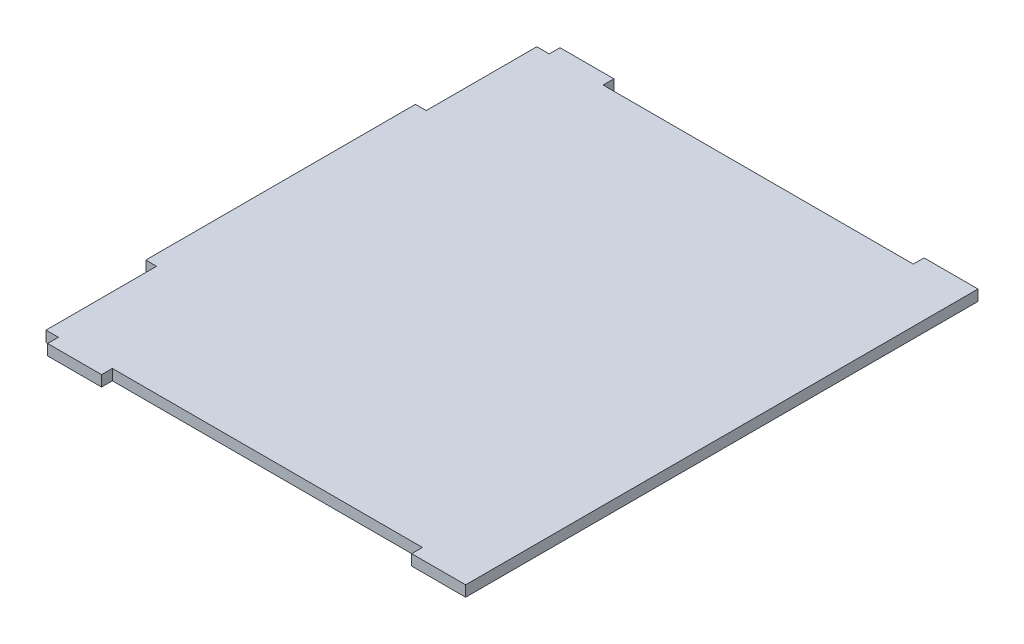
ISO-10303-21;
HEADER;
FILE_DESCRIPTION(('STEP AP214'),'2;1');
FILE_NAME('part.step','',(''),(''),'','','');
FILE_SCHEMA(('AUTOMOTIVE_DESIGN { 1 0 10303 214 1 1 1 1 }'));
ENDSEC;
DATA;
#1=APPLICATION_CONTEXT('core data for automotive mechanical design processes');
#2=APPLICATION_PROTOCOL_DEFINITION('international standard','automotive_design',2000,#1);
#3=PRODUCT_CONTEXT('',#1,'mechanical');
#4=PRODUCT('Part','Part','',(#3));
#5=PRODUCT_RELATED_PRODUCT_CATEGORY('part','',(#4));
#6=PRODUCT_DEFINITION_FORMATION('','',#4);
#7=PRODUCT_DEFINITION_CONTEXT('part definition',#1,'design');
#8=PRODUCT_DEFINITION('design','',#6,#7);
#9=PRODUCT_DEFINITION_SHAPE('','',#8);
#10=(LENGTH_UNIT() NAMED_UNIT(*) SI_UNIT(.MILLI.,.METRE.));
#11=(NAMED_UNIT(*) PLANE_ANGLE_UNIT() SI_UNIT($,.RADIAN.));
#12=(NAMED_UNIT(*) SI_UNIT($,.STERADIAN.) SOLID_ANGLE_UNIT());
#13=UNCERTAINTY_MEASURE_WITH_UNIT(LENGTH_MEASURE(1.E-05),#10,'distance_accuracy_value','');
#14=(GEOMETRIC_REPRESENTATION_CONTEXT(3) GLOBAL_UNCERTAINTY_ASSIGNED_CONTEXT((#13)) GLOBAL_UNIT_ASSIGNED_CONTEXT((#10,
#11,#12)) REPRESENTATION_CONTEXT('',''));
#15=CARTESIAN_POINT('',(0.,0.,0.));
#16=DIRECTION('',(0.,0.,1.));
#17=DIRECTION('',(1.,0.,0.));
#18=AXIS2_PLACEMENT_3D('',#15,#16,#17);
#19=CARTESIAN_POINT('',(61.8007292383684,4.,-95.0000000000068));
#20=DIRECTION('',(0.,0.,-1.));
#21=DIRECTION('',(-1.,0.,0.));
#22=AXIS2_PLACEMENT_3D('',#19,#20,#21);
#23=PLANE('',#22);
#24=DIRECTION('',(1.,0.,0.));
#25=VECTOR('',#24,1.);
#26=CARTESIAN_POINT('',(61.8007292383684,0.,-95.0000000000068));
#27=LINE('',#26,#25);
#28=CARTESIAN_POINT('',(61.8007292383684,0.,-95.0000000000068));
#29=VERTEX_POINT('',#28);
#30=CARTESIAN_POINT('',(81.805,0.,-95.0000000000068));
#31=VERTEX_POINT('',#30);
#32=EDGE_CURVE('E205',#29,#31,#27,.T.);
#33=ORIENTED_EDGE('',*,*,#32,.F.);
#34=DIRECTION('',(0.,-1.,0.));
#35=VECTOR('',#34,1.);
#36=CARTESIAN_POINT('',(61.8007292383684,4.,-95.0000000000068));
#37=LINE('',#36,#35);
#38=CARTESIAN_POINT('',(61.8007292383684,4.,-95.0000000000068));
#39=VERTEX_POINT('',#38);
#40=EDGE_CURVE('E11',#39,#29,#37,.T.);
#41=ORIENTED_EDGE('',*,*,#40,.F.);
#42=DIRECTION('',(1.,0.,0.));
#43=VECTOR('',#42,1.);
#44=CARTESIAN_POINT('',(61.8007292383684,4.,-95.0000000000068));
#45=LINE('',#44,#43);
#46=CARTESIAN_POINT('',(81.805,4.,-95.0000000000068));
#47=VERTEX_POINT('',#46);
#48=EDGE_CURVE('E257',#39,#47,#45,.T.);
#49=ORIENTED_EDGE('',*,*,#48,.T.);
#50=DIRECTION('',(0.,-1.,0.));
#51=VECTOR('',#50,1.);
#52=CARTESIAN_POINT('',(81.805,4.,-95.0000000000068));
#53=LINE('',#52,#51);
#54=EDGE_CURVE('E39',#47,#31,#53,.T.);
#55=ORIENTED_EDGE('',*,*,#54,.T.);
#56=EDGE_LOOP('',(#33,#41,#49,#55));
#57=FACE_BOUND('',#56,.T.);
#58=ADVANCED_FACE('F36',(#57),#23,.T.);
#59=CARTESIAN_POINT('',(61.8007292383684,4.,-91.0000000000001));
#60=DIRECTION('',(-1.,0.,0.));
#61=DIRECTION('',(0.,0.,1.));
#62=AXIS2_PLACEMENT_3D('',#59,#60,#61);
#63=PLANE('',#62);
#64=DIRECTION('',(0.,0.,-1.));
#65=VECTOR('',#64,1.);
#66=CARTESIAN_POINT('',(61.8007292383684,0.,-91.0000000000001));
#67=LINE('',#66,#65);
#68=CARTESIAN_POINT('',(61.8007292383684,0.,-91.0000000000001));
#69=VERTEX_POINT('',#68);
#70=EDGE_CURVE('E255',#69,#29,#67,.T.);
#71=ORIENTED_EDGE('',*,*,#70,.F.);
#72=DIRECTION('',(0.,-1.,0.));
#73=VECTOR('',#72,1.);
#74=CARTESIAN_POINT('',(61.8007292383684,4.,-91.0000000000001));
#75=LINE('',#74,#73);
#76=CARTESIAN_POINT('',(61.8007292383684,4.,-91.0000000000001));
#77=VERTEX_POINT('',#76);
#78=EDGE_CURVE('E45',#77,#69,#75,.T.);
#79=ORIENTED_EDGE('',*,*,#78,.F.);
#80=DIRECTION('',(0.,0.,-1.));
#81=VECTOR('',#80,1.);
#82=CARTESIAN_POINT('',(61.8007292383684,4.,-91.0000000000001));
#83=LINE('',#82,#81);
#84=EDGE_CURVE('E195',#77,#39,#83,.T.);
#85=ORIENTED_EDGE('',*,*,#84,.T.);
#86=ORIENTED_EDGE('',*,*,#40,.T.);
#87=EDGE_LOOP('',(#71,#79,#85,#86));
#88=FACE_BOUND('',#87,.T.);
#89=ADVANCED_FACE('F298',(#88),#63,.T.);
#90=CARTESIAN_POINT('',(-53.1992707616316,4.,-91.0000000000001));
#91=DIRECTION('',(0.,0.,-1.));
#92=DIRECTION('',(-1.,0.,0.));
#93=AXIS2_PLACEMENT_3D('',#90,#91,#92);
#94=PLANE('',#93);
#95=DIRECTION('',(1.,0.,0.));
#96=VECTOR('',#95,1.);
#97=CARTESIAN_POINT('',(-53.1992707616316,0.,-91.0000000000001));
#98=LINE('',#97,#96);
#99=CARTESIAN_POINT('',(-53.1992707616316,0.,-91.0000000000001));
#100=VERTEX_POINT('',#99);
#101=EDGE_CURVE('E182',#100,#69,#98,.T.);
#102=ORIENTED_EDGE('',*,*,#101,.F.);
#103=DIRECTION('',(0.,-1.,0.));
#104=VECTOR('',#103,1.);
#105=CARTESIAN_POINT('',(-53.1992707616316,4.,-91.0000000000001));
#106=LINE('',#105,#104);
#107=CARTESIAN_POINT('',(-53.1992707616316,4.,-91.0000000000001));
#108=VERTEX_POINT('',#107);
#109=EDGE_CURVE('E177',#108,#100,#106,.T.);
#110=ORIENTED_EDGE('',*,*,#109,.F.);
#111=DIRECTION('',(1.,0.,0.));
#112=VECTOR('',#111,1.);
#113=CARTESIAN_POINT('',(-53.1992707616316,4.,-91.0000000000001));
#114=LINE('',#113,#112);
#115=EDGE_CURVE('E180',#108,#77,#114,.T.);
#116=ORIENTED_EDGE('',*,*,#115,.T.);
#117=ORIENTED_EDGE('',*,*,#78,.T.);
#118=EDGE_LOOP('',(#102,#110,#116,#117));
#119=FACE_BOUND('',#118,.T.);
#120=ADVANCED_FACE('F179',(#119),#94,.T.);
#121=CARTESIAN_POINT('',(-53.1992707616316,4.,-95.0000000000068));
#122=DIRECTION('',(1.,0.,0.));
#123=DIRECTION('',(0.,0.,-1.));
#124=AXIS2_PLACEMENT_3D('',#121,#122,#123);
#125=PLANE('',#124);
#126=DIRECTION('',(0.,0.,1.));
#127=VECTOR('',#126,1.);
#128=CARTESIAN_POINT('',(-53.1992707616316,0.,-95.0000000000068));
#129=LINE('',#128,#127);
#130=CARTESIAN_POINT('',(-53.1992707616316,0.,-95.0000000000068));
#131=VERTEX_POINT('',#130);
#132=EDGE_CURVE('E252',#131,#100,#129,.T.);
#133=ORIENTED_EDGE('',*,*,#132,.F.);
#134=DIRECTION('',(0.,-1.,0.));
#135=VECTOR('',#134,1.);
#136=CARTESIAN_POINT('',(-53.1992707616316,4.,-95.0000000000068));
#137=LINE('',#136,#135);
#138=CARTESIAN_POINT('',(-53.1992707616316,4.,-95.0000000000068));
#139=VERTEX_POINT('',#138);
#140=EDGE_CURVE('E187',#139,#131,#137,.T.);
#141=ORIENTED_EDGE('',*,*,#140,.F.);
#142=DIRECTION('',(0.,0.,1.));
#143=VECTOR('',#142,1.);
#144=CARTESIAN_POINT('',(-53.1992707616316,4.,-95.0000000000068));
#145=LINE('',#144,#143);
#146=EDGE_CURVE('E193',#139,#108,#145,.T.);
#147=ORIENTED_EDGE('',*,*,#146,.T.);
#148=ORIENTED_EDGE('',*,*,#109,.T.);
#149=EDGE_LOOP('',(#133,#141,#147,#148));
#150=FACE_BOUND('',#149,.T.);
#151=ADVANCED_FACE('F197',(#150),#125,.T.);
#152=CARTESIAN_POINT('',(-73.1992707616316,4.,-95.0000000000067));
#153=DIRECTION('',(0.,0.,-1.));
#154=DIRECTION('',(-1.,0.,0.));
#155=AXIS2_PLACEMENT_3D('',#152,#153,#154);
#156=PLANE('',#155);
#157=DIRECTION('',(1.,0.,0.));
#158=VECTOR('',#157,1.);
#159=CARTESIAN_POINT('',(-73.1992707616316,0.,-95.0000000000067));
#160=LINE('',#159,#158);
#161=CARTESIAN_POINT('',(-73.1992707616316,0.,-95.0000000000067));
#162=VERTEX_POINT('',#161);
#163=EDGE_CURVE('E249',#162,#131,#160,.T.);
#164=ORIENTED_EDGE('',*,*,#163,.F.);
#165=DIRECTION('',(0.,-1.,0.));
#166=VECTOR('',#165,1.);
#167=CARTESIAN_POINT('',(-73.1992707616316,4.,-95.0000000000067));
#168=LINE('',#167,#166);
#169=CARTESIAN_POINT('',(-73.1992707616316,4.,-95.0000000000067));
#170=VERTEX_POINT('',#169);
#171=EDGE_CURVE('E261',#170,#162,#168,.T.);
#172=ORIENTED_EDGE('',*,*,#171,.F.);
#173=DIRECTION('',(1.,0.,0.));
#174=VECTOR('',#173,1.);
#175=CARTESIAN_POINT('',(-73.1992707616316,4.,-95.0000000000067));
#176=LINE('',#175,#174);
#177=EDGE_CURVE('E198',#170,#139,#176,.T.);
#178=ORIENTED_EDGE('',*,*,#177,.T.);
#179=ORIENTED_EDGE('',*,*,#140,.T.);
#180=EDGE_LOOP('',(#164,#172,#178,#179));
#181=FACE_BOUND('',#180,.T.);
#182=ADVANCED_FACE('F311',(#181),#156,.T.);
#183=CARTESIAN_POINT('',(-73.1992707616316,4.,-91.0000000000001));
#184=DIRECTION('',(-1.,0.,0.));
#185=DIRECTION('',(0.,0.,1.));
#186=AXIS2_PLACEMENT_3D('',#183,#184,#185);
#187=PLANE('',#186);
#188=DIRECTION('',(0.,0.,-1.));
#189=VECTOR('',#188,1.);
#190=CARTESIAN_POINT('',(-73.1992707616316,0.,-91.0000000000001));
#191=LINE('',#190,#189);
#192=CARTESIAN_POINT('',(-73.1992707616316,0.,-91.0000000000001));
#193=VERTEX_POINT('',#192);
#194=EDGE_CURVE('E246',#193,#162,#191,.T.);
#195=ORIENTED_EDGE('',*,*,#194,.F.);
#196=DIRECTION('',(0.,-1.,0.));
#197=VECTOR('',#196,1.);
#198=CARTESIAN_POINT('',(-73.1992707616316,4.,-91.0000000000001));
#199=LINE('',#198,#197);
#200=CARTESIAN_POINT('',(-73.1992707616316,4.,-91.0000000000001));
#201=VERTEX_POINT('',#200);
#202=EDGE_CURVE('E263',#201,#193,#199,.T.);
#203=ORIENTED_EDGE('',*,*,#202,.F.);
#204=DIRECTION('',(0.,0.,-1.));
#205=VECTOR('',#204,1.);
#206=CARTESIAN_POINT('',(-73.1992707616316,4.,-91.0000000000001));
#207=LINE('',#206,#205);
#208=EDGE_CURVE('E200',#201,#170,#207,.T.);
#209=ORIENTED_EDGE('',*,*,#208,.T.);
#210=ORIENTED_EDGE('',*,*,#171,.T.);
#211=EDGE_LOOP('',(#195,#203,#209,#210));
#212=FACE_BOUND('',#211,.T.);
#213=ADVANCED_FACE('F314',(#212),#187,.T.);
#214=CARTESIAN_POINT('',(-77.8049999999999,4.,-91.0000000000001));
#215=DIRECTION('',(0.,0.,-1.));
#216=DIRECTION('',(-1.,0.,0.));
#217=AXIS2_PLACEMENT_3D('',#214,#215,#216);
#218=PLANE('',#217);
#219=DIRECTION('',(1.,0.,0.));
#220=VECTOR('',#219,1.);
#221=CARTESIAN_POINT('',(-77.8049999999999,0.,-91.0000000000001));
#222=LINE('',#221,#220);
#223=CARTESIAN_POINT('',(-77.8049999999999,0.,-91.0000000000001));
#224=VERTEX_POINT('',#223);
#225=EDGE_CURVE('E243',#224,#193,#222,.T.);
#226=ORIENTED_EDGE('',*,*,#225,.F.);
#227=DIRECTION('',(0.,-1.,0.));
#228=VECTOR('',#227,1.);
#229=CARTESIAN_POINT('',(-77.8049999999999,4.,-91.0000000000001));
#230=LINE('',#229,#228);
#231=CARTESIAN_POINT('',(-77.8049999999999,4.,-91.0000000000001));
#232=VERTEX_POINT('',#231);
#233=EDGE_CURVE('E265',#232,#224,#230,.T.);
#234=ORIENTED_EDGE('',*,*,#233,.F.);
#235=DIRECTION('',(1.,0.,0.));
#236=VECTOR('',#235,1.);
#237=CARTESIAN_POINT('',(-77.8049999999999,4.,-91.0000000000001));
#238=LINE('',#237,#236);
#239=EDGE_CURVE('E551',#232,#201,#238,.T.);
#240=ORIENTED_EDGE('',*,*,#239,.T.);
#241=ORIENTED_EDGE('',*,*,#202,.T.);
#242=EDGE_LOOP('',(#226,#234,#240,#241));
#243=FACE_BOUND('',#242,.T.);
#244=ADVANCED_FACE('F318',(#243),#218,.T.);
#245=CARTESIAN_POINT('',(-77.8049999999999,4.,-50.));
#246=DIRECTION('',(-1.,0.,0.));
#247=DIRECTION('',(0.,0.,1.));
#248=AXIS2_PLACEMENT_3D('',#245,#246,#247);
#249=PLANE('',#248);
#250=DIRECTION('',(0.,0.,-1.));
#251=VECTOR('',#250,1.);
#252=CARTESIAN_POINT('',(-77.8049999999999,0.,-50.));
#253=LINE('',#252,#251);
#254=CARTESIAN_POINT('',(-77.8049999999999,0.,-50.));
#255=VERTEX_POINT('',#254);
#256=EDGE_CURVE('E240',#255,#224,#253,.T.);
#257=ORIENTED_EDGE('',*,*,#256,.F.);
#258=DIRECTION('',(0.,-1.,0.));
#259=VECTOR('',#258,1.);
#260=CARTESIAN_POINT('',(-77.8049999999999,4.,-50.));
#261=LINE('',#260,#259);
#262=CARTESIAN_POINT('',(-77.8049999999999,4.,-50.));
#263=VERTEX_POINT('',#262);
#264=EDGE_CURVE('E267',#263,#255,#261,.T.);
#265=ORIENTED_EDGE('',*,*,#264,.F.);
#266=DIRECTION('',(0.,0.,-1.));
#267=VECTOR('',#266,1.);
#268=CARTESIAN_POINT('',(-77.8049999999999,4.,-50.));
#269=LINE('',#268,#267);
#270=EDGE_CURVE('E544',#263,#232,#269,.T.);
#271=ORIENTED_EDGE('',*,*,#270,.T.);
#272=ORIENTED_EDGE('',*,*,#233,.T.);
#273=EDGE_LOOP('',(#257,#265,#271,#272));
#274=FACE_BOUND('',#273,.T.);
#275=ADVANCED_FACE('F322',(#274),#249,.T.);
#276=CARTESIAN_POINT('',(-77.8049999999999,4.,-50.));
#277=DIRECTION('',(0.,0.,1.));
#278=DIRECTION('',(1.,0.,0.));
#279=AXIS2_PLACEMENT_3D('',#276,#277,#278);
#280=PLANE('',#279);
#281=DIRECTION('',(-1.,0.,0.));
#282=VECTOR('',#281,1.);
#283=CARTESIAN_POINT('',(-77.8049999999999,0.,-50.));
#284=LINE('',#283,#282);
#285=CARTESIAN_POINT('',(-81.805,0.,-50.));
#286=VERTEX_POINT('',#285);
#287=EDGE_CURVE('E237',#255,#286,#284,.T.);
#288=ORIENTED_EDGE('',*,*,#287,.T.);
#289=DIRECTION('',(0.,-1.,0.));
#290=VECTOR('',#289,1.);
#291=CARTESIAN_POINT('',(-81.805,4.,-50.));
#292=LINE('',#291,#290);
#293=CARTESIAN_POINT('',(-81.805,4.,-50.));
#294=VERTEX_POINT('',#293);
#295=EDGE_CURVE('E269',#294,#286,#292,.T.);
#296=ORIENTED_EDGE('',*,*,#295,.F.);
#297=DIRECTION('',(-1.,0.,0.));
#298=VECTOR('',#297,1.);
#299=CARTESIAN_POINT('',(-77.8049999999999,4.,-50.));
#300=LINE('',#299,#298);
#301=EDGE_CURVE('E553',#263,#294,#300,.T.);
#302=ORIENTED_EDGE('',*,*,#301,.F.);
#303=ORIENTED_EDGE('',*,*,#264,.T.);
#304=EDGE_LOOP('',(#288,#296,#302,#303));
#305=FACE_BOUND('',#304,.T.);
#306=ADVANCED_FACE('F326',(#305),#280,.F.);
#307=CARTESIAN_POINT('',(-81.805,4.,50.));
#308=DIRECTION('',(-1.,0.,0.));
#309=DIRECTION('',(0.,0.,1.));
#310=AXIS2_PLACEMENT_3D('',#307,#308,#309);
#311=PLANE('',#310);
#312=DIRECTION('',(0.,0.,-1.));
#313=VECTOR('',#312,1.);
#314=CARTESIAN_POINT('',(-81.805,0.,50.));
#315=LINE('',#314,#313);
#316=CARTESIAN_POINT('',(-81.805,0.,50.));
#317=VERTEX_POINT('',#316);
#318=EDGE_CURVE('E234',#317,#286,#315,.T.);
#319=ORIENTED_EDGE('',*,*,#318,.F.);
#320=DIRECTION('',(0.,-1.,0.));
#321=VECTOR('',#320,1.);
#322=CARTESIAN_POINT('',(-81.805,4.,50.));
#323=LINE('',#322,#321);
#324=CARTESIAN_POINT('',(-81.805,4.,50.));
#325=VERTEX_POINT('',#324);
#326=EDGE_CURVE('E271',#325,#317,#323,.T.);
#327=ORIENTED_EDGE('',*,*,#326,.F.);
#328=DIRECTION('',(0.,0.,-1.));
#329=VECTOR('',#328,1.);
#330=CARTESIAN_POINT('',(-81.805,4.,50.));
#331=LINE('',#330,#329);
#332=EDGE_CURVE('E538',#325,#294,#331,.T.);
#333=ORIENTED_EDGE('',*,*,#332,.T.);
#334=ORIENTED_EDGE('',*,*,#295,.T.);
#335=EDGE_LOOP('',(#319,#327,#333,#334));
#336=FACE_BOUND('',#335,.T.);
#337=ADVANCED_FACE('F330',(#336),#311,.T.);
#338=CARTESIAN_POINT('',(-81.805,4.,50.));
#339=DIRECTION('',(0.,0.,-1.));
#340=DIRECTION('',(-1.,0.,0.));
#341=AXIS2_PLACEMENT_3D('',#338,#339,#340);
#342=PLANE('',#341);
#343=DIRECTION('',(1.,0.,0.));
#344=VECTOR('',#343,1.);
#345=CARTESIAN_POINT('',(-81.805,0.,50.));
#346=LINE('',#345,#344);
#347=CARTESIAN_POINT('',(-77.8049999999999,0.,50.));
#348=VERTEX_POINT('',#347);
#349=EDGE_CURVE('E231',#317,#348,#346,.T.);
#350=ORIENTED_EDGE('',*,*,#349,.T.);
#351=DIRECTION('',(0.,-1.,0.));
#352=VECTOR('',#351,1.);
#353=CARTESIAN_POINT('',(-77.8049999999999,4.,50.));
#354=LINE('',#353,#352);
#355=CARTESIAN_POINT('',(-77.8049999999999,4.,50.));
#356=VERTEX_POINT('',#355);
#357=EDGE_CURVE('E273',#356,#348,#354,.T.);
#358=ORIENTED_EDGE('',*,*,#357,.F.);
#359=DIRECTION('',(1.,0.,0.));
#360=VECTOR('',#359,1.);
#361=CARTESIAN_POINT('',(-81.805,4.,50.));
#362=LINE('',#361,#360);
#363=EDGE_CURVE('E558',#325,#356,#362,.T.);
#364=ORIENTED_EDGE('',*,*,#363,.F.);
#365=ORIENTED_EDGE('',*,*,#326,.T.);
#366=EDGE_LOOP('',(#350,#358,#364,#365));
#367=FACE_BOUND('',#366,.T.);
#368=ADVANCED_FACE('F334',(#367),#342,.F.);
#369=CARTESIAN_POINT('',(-77.8049999999999,4.,91.0000000000001));
#370=DIRECTION('',(-1.,0.,0.));
#371=DIRECTION('',(0.,0.,1.));
#372=AXIS2_PLACEMENT_3D('',#369,#370,#371);
#373=PLANE('',#372);
#374=DIRECTION('',(0.,0.,-1.));
#375=VECTOR('',#374,1.);
#376=CARTESIAN_POINT('',(-77.8049999999999,0.,91.0000000000001));
#377=LINE('',#376,#375);
#378=CARTESIAN_POINT('',(-77.8049999999999,0.,91.0000000000001));
#379=VERTEX_POINT('',#378);
#380=EDGE_CURVE('E228',#379,#348,#377,.T.);
#381=ORIENTED_EDGE('',*,*,#380,.F.);
#382=DIRECTION('',(0.,-1.,0.));
#383=VECTOR('',#382,1.);
#384=CARTESIAN_POINT('',(-77.8049999999999,4.,91.0000000000001));
#385=LINE('',#384,#383);
#386=CARTESIAN_POINT('',(-77.8049999999999,4.,91.0000000000001));
#387=VERTEX_POINT('',#386);
#388=EDGE_CURVE('E275',#387,#379,#385,.T.);
#389=ORIENTED_EDGE('',*,*,#388,.F.);
#390=DIRECTION('',(0.,0.,-1.));
#391=VECTOR('',#390,1.);
#392=CARTESIAN_POINT('',(-77.8049999999999,4.,91.0000000000001));
#393=LINE('',#392,#391);
#394=EDGE_CURVE('E531',#387,#356,#393,.T.);
#395=ORIENTED_EDGE('',*,*,#394,.T.);
#396=ORIENTED_EDGE('',*,*,#357,.T.);
#397=EDGE_LOOP('',(#381,#389,#395,#396));
#398=FACE_BOUND('',#397,.T.);
#399=ADVANCED_FACE('F338',(#398),#373,.T.);
#400=CARTESIAN_POINT('',(-77.8049999999999,4.,91.0000000000001));
#401=DIRECTION('',(0.,0.,-1.));
#402=DIRECTION('',(-1.,0.,0.));
#403=AXIS2_PLACEMENT_3D('',#400,#401,#402);
#404=PLANE('',#403);
#405=DIRECTION('',(1.,0.,0.));
#406=VECTOR('',#405,1.);
#407=CARTESIAN_POINT('',(-77.8049999999999,0.,91.0000000000001));
#408=LINE('',#407,#406);
#409=CARTESIAN_POINT('',(-73.1992707616316,0.,91.0000000000001));
#410=VERTEX_POINT('',#409);
#411=EDGE_CURVE('E226',#379,#410,#408,.T.);
#412=ORIENTED_EDGE('',*,*,#411,.T.);
#413=DIRECTION('',(0.,-1.,0.));
#414=VECTOR('',#413,1.);
#415=CARTESIAN_POINT('',(-73.1992707616316,4.,91.0000000000001));
#416=LINE('',#415,#414);
#417=CARTESIAN_POINT('',(-73.1992707616316,4.,91.0000000000001));
#418=VERTEX_POINT('',#417);
#419=EDGE_CURVE('E277',#418,#410,#416,.T.);
#420=ORIENTED_EDGE('',*,*,#419,.F.);
#421=DIRECTION('',(1.,0.,0.));
#422=VECTOR('',#421,1.);
#423=CARTESIAN_POINT('',(-77.8049999999999,4.,91.0000000000001));
#424=LINE('',#423,#422);
#425=EDGE_CURVE('E561',#387,#418,#424,.T.);
#426=ORIENTED_EDGE('',*,*,#425,.F.);
#427=ORIENTED_EDGE('',*,*,#388,.T.);
#428=EDGE_LOOP('',(#412,#420,#426,#427));
#429=FACE_BOUND('',#428,.T.);
#430=ADVANCED_FACE('F342',(#429),#404,.F.);
#431=CARTESIAN_POINT('',(-73.1992707616316,4.,91.0000000000001));
#432=DIRECTION('',(1.,0.,0.));
#433=DIRECTION('',(0.,0.,-1.));
#434=AXIS2_PLACEMENT_3D('',#431,#432,#433);
#435=PLANE('',#434);
#436=DIRECTION('',(0.,0.,1.));
#437=VECTOR('',#436,1.);
#438=CARTESIAN_POINT('',(-73.1992707616316,0.,91.0000000000001));
#439=LINE('',#438,#437);
#440=CARTESIAN_POINT('',(-73.1992707616316,0.,95.0000000000068));
#441=VERTEX_POINT('',#440);
#442=EDGE_CURVE('E223',#410,#441,#439,.T.);
#443=ORIENTED_EDGE('',*,*,#442,.T.);
#444=DIRECTION('',(0.,-1.,0.));
#445=VECTOR('',#444,1.);
#446=CARTESIAN_POINT('',(-73.1992707616316,4.,95.0000000000068));
#447=LINE('',#446,#445);
#448=CARTESIAN_POINT('',(-73.1992707616316,4.,95.0000000000068));
#449=VERTEX_POINT('',#448);
#450=EDGE_CURVE('E280',#449,#441,#447,.T.);
#451=ORIENTED_EDGE('',*,*,#450,.F.);
#452=DIRECTION('',(0.,0.,1.));
#453=VECTOR('',#452,1.);
#454=CARTESIAN_POINT('',(-73.1992707616316,4.,91.0000000000001));
#455=LINE('',#454,#453);
#456=EDGE_CURVE('E563',#418,#449,#455,.T.);
#457=ORIENTED_EDGE('',*,*,#456,.F.);
#458=ORIENTED_EDGE('',*,*,#419,.T.);
#459=EDGE_LOOP('',(#443,#451,#457,#458));
#460=FACE_BOUND('',#459,.T.);
#461=ADVANCED_FACE('F346',(#460),#435,.F.);
#462=CARTESIAN_POINT('',(-53.1992707616316,4.,95.0000000000068));
#463=DIRECTION('',(0.,0.,1.));
#464=DIRECTION('',(1.,0.,0.));
#465=AXIS2_PLACEMENT_3D('',#462,#463,#464);
#466=PLANE('',#465);
#467=DIRECTION('',(-1.,0.,0.));
#468=VECTOR('',#467,1.);
#469=CARTESIAN_POINT('',(-53.1992707616316,0.,95.0000000000068));
#470=LINE('',#469,#468);
#471=CARTESIAN_POINT('',(-53.1992707616316,0.,95.0000000000068));
#472=VERTEX_POINT('',#471);
#473=EDGE_CURVE('E220',#472,#441,#470,.T.);
#474=ORIENTED_EDGE('',*,*,#473,.F.);
#475=DIRECTION('',(0.,-1.,0.));
#476=VECTOR('',#475,1.);
#477=CARTESIAN_POINT('',(-53.1992707616316,4.,95.0000000000068));
#478=LINE('',#477,#476);
#479=CARTESIAN_POINT('',(-53.1992707616316,4.,95.0000000000068));
#480=VERTEX_POINT('',#479);
#481=EDGE_CURVE('E282',#480,#472,#478,.T.);
#482=ORIENTED_EDGE('',*,*,#481,.F.);
#483=DIRECTION('',(-1.,0.,0.));
#484=VECTOR('',#483,1.);
#485=CARTESIAN_POINT('',(-53.1992707616316,4.,95.0000000000068));
#486=LINE('',#485,#484);
#487=EDGE_CURVE('E521',#480,#449,#486,.T.);
#488=ORIENTED_EDGE('',*,*,#487,.T.);
#489=ORIENTED_EDGE('',*,*,#450,.T.);
#490=EDGE_LOOP('',(#474,#482,#488,#489));
#491=FACE_BOUND('',#490,.T.);
#492=ADVANCED_FACE('F350',(#491),#466,.T.);
#493=CARTESIAN_POINT('',(-53.1992707616316,4.,95.0000000000068));
#494=DIRECTION('',(-1.,0.,0.));
#495=DIRECTION('',(0.,0.,1.));
#496=AXIS2_PLACEMENT_3D('',#493,#494,#495);
#497=PLANE('',#496);
#498=DIRECTION('',(0.,0.,-1.));
#499=VECTOR('',#498,1.);
#500=CARTESIAN_POINT('',(-53.1992707616316,0.,95.0000000000068));
#501=LINE('',#500,#499);
#502=CARTESIAN_POINT('',(-53.1992707616316,0.,91.0000000000001));
#503=VERTEX_POINT('',#502);
#504=EDGE_CURVE('E218',#472,#503,#501,.T.);
#505=ORIENTED_EDGE('',*,*,#504,.T.);
#506=DIRECTION('',(0.,-1.,0.));
#507=VECTOR('',#506,1.);
#508=CARTESIAN_POINT('',(-53.1992707616316,4.,91.0000000000001));
#509=LINE('',#508,#507);
#510=CARTESIAN_POINT('',(-53.1992707616316,4.,91.0000000000001));
#511=VERTEX_POINT('',#510);
#512=EDGE_CURVE('E284',#511,#503,#509,.T.);
#513=ORIENTED_EDGE('',*,*,#512,.F.);
#514=DIRECTION('',(0.,0.,-1.));
#515=VECTOR('',#514,1.);
#516=CARTESIAN_POINT('',(-53.1992707616316,4.,95.0000000000068));
#517=LINE('',#516,#515);
#518=EDGE_CURVE('E515',#480,#511,#517,.T.);
#519=ORIENTED_EDGE('',*,*,#518,.F.);
#520=ORIENTED_EDGE('',*,*,#481,.T.);
#521=EDGE_LOOP('',(#505,#513,#519,#520));
#522=FACE_BOUND('',#521,.T.);
#523=ADVANCED_FACE('F354',(#522),#497,.F.);
#524=CARTESIAN_POINT('',(-53.1992707616316,4.,91.0000000000001));
#525=DIRECTION('',(0.,0.,-1.));
#526=DIRECTION('',(-1.,0.,0.));
#527=AXIS2_PLACEMENT_3D('',#524,#525,#526);
#528=PLANE('',#527);
#529=DIRECTION('',(1.,0.,0.));
#530=VECTOR('',#529,1.);
#531=CARTESIAN_POINT('',(-53.1992707616316,0.,91.0000000000001));
#532=LINE('',#531,#530);
#533=CARTESIAN_POINT('',(61.8007292383684,0.,91.0000000000001));
#534=VERTEX_POINT('',#533);
#535=EDGE_CURVE('E216',#503,#534,#532,.T.);
#536=ORIENTED_EDGE('',*,*,#535,.T.);
#537=DIRECTION('',(0.,-1.,0.));
#538=VECTOR('',#537,1.);
#539=CARTESIAN_POINT('',(61.8007292383684,4.,91.0000000000001));
#540=LINE('',#539,#538);
#541=CARTESIAN_POINT('',(61.8007292383684,4.,91.0000000000001));
#542=VERTEX_POINT('',#541);
#543=EDGE_CURVE('E287',#542,#534,#540,.T.);
#544=ORIENTED_EDGE('',*,*,#543,.F.);
#545=DIRECTION('',(1.,0.,0.));
#546=VECTOR('',#545,1.);
#547=CARTESIAN_POINT('',(-53.1992707616316,4.,91.0000000000001));
#548=LINE('',#547,#546);
#549=EDGE_CURVE('E512',#511,#542,#548,.T.);
#550=ORIENTED_EDGE('',*,*,#549,.F.);
#551=ORIENTED_EDGE('',*,*,#512,.T.);
#552=EDGE_LOOP('',(#536,#544,#550,#551));
#553=FACE_BOUND('',#552,.T.);
#554=ADVANCED_FACE('F358',(#553),#528,.F.);
#555=CARTESIAN_POINT('',(61.8007292383684,4.,91.0000000000001));
#556=DIRECTION('',(1.,0.,0.));
#557=DIRECTION('',(0.,0.,-1.));
#558=AXIS2_PLACEMENT_3D('',#555,#556,#557);
#559=PLANE('',#558);
#560=DIRECTION('',(0.,0.,1.));
#561=VECTOR('',#560,1.);
#562=CARTESIAN_POINT('',(61.8007292383684,0.,91.0000000000001));
#563=LINE('',#562,#561);
#564=CARTESIAN_POINT('',(61.8007292383685,0.,95.0000000000067));
#565=VERTEX_POINT('',#564);
#566=EDGE_CURVE('E214',#534,#565,#563,.T.);
#567=ORIENTED_EDGE('',*,*,#566,.T.);
#568=DIRECTION('',(0.,-1.,0.));
#569=VECTOR('',#568,1.);
#570=CARTESIAN_POINT('',(61.8007292383685,4.,95.0000000000067));
#571=LINE('',#570,#569);
#572=CARTESIAN_POINT('',(61.8007292383685,4.,95.0000000000067));
#573=VERTEX_POINT('',#572);
#574=EDGE_CURVE('E290',#573,#565,#571,.T.);
#575=ORIENTED_EDGE('',*,*,#574,.F.);
#576=DIRECTION('',(0.,0.,1.));
#577=VECTOR('',#576,1.);
#578=CARTESIAN_POINT('',(61.8007292383684,4.,91.0000000000001));
#579=LINE('',#578,#577);
#580=EDGE_CURVE('E510',#542,#573,#579,.T.);
#581=ORIENTED_EDGE('',*,*,#580,.F.);
#582=ORIENTED_EDGE('',*,*,#543,.T.);
#583=EDGE_LOOP('',(#567,#575,#581,#582));
#584=FACE_BOUND('',#583,.T.);
#585=ADVANCED_FACE('F362',(#584),#559,.F.);
#586=CARTESIAN_POINT('',(61.8007292383685,4.,95.0000000000067));
#587=DIRECTION('',(0.,0.,-1.));
#588=DIRECTION('',(-1.,0.,0.));
#589=AXIS2_PLACEMENT_3D('',#586,#587,#588);
#590=PLANE('',#589);
#591=DIRECTION('',(1.,0.,0.));
#592=VECTOR('',#591,1.);
#593=CARTESIAN_POINT('',(61.8007292383685,0.,95.0000000000067));
#594=LINE('',#593,#592);
#595=CARTESIAN_POINT('',(81.8050000000001,0.,95.0000000000068));
#596=VERTEX_POINT('',#595);
#597=EDGE_CURVE('E211',#565,#596,#594,.T.);
#598=ORIENTED_EDGE('',*,*,#597,.T.);
#599=DIRECTION('',(0.,-1.,0.));
#600=VECTOR('',#599,1.);
#601=CARTESIAN_POINT('',(81.8050000000001,4.,95.0000000000068));
#602=LINE('',#601,#600);
#603=CARTESIAN_POINT('',(81.8050000000001,4.,95.0000000000068));
#604=VERTEX_POINT('',#603);
#605=EDGE_CURVE('E292',#604,#596,#602,.T.);
#606=ORIENTED_EDGE('',*,*,#605,.F.);
#607=DIRECTION('',(1.,0.,0.));
#608=VECTOR('',#607,1.);
#609=CARTESIAN_POINT('',(61.8007292383685,4.,95.0000000000067));
#610=LINE('',#609,#608);
#611=EDGE_CURVE('E569',#573,#604,#610,.T.);
#612=ORIENTED_EDGE('',*,*,#611,.F.);
#613=ORIENTED_EDGE('',*,*,#574,.T.);
#614=EDGE_LOOP('',(#598,#606,#612,#613));
#615=FACE_BOUND('',#614,.T.);
#616=ADVANCED_FACE('F366',(#615),#590,.F.);
#617=CARTESIAN_POINT('',(81.805,4.,-95.0000000000068));
#618=DIRECTION('',(1.,0.,0.));
#619=DIRECTION('',(0.,0.,-1.));
#620=AXIS2_PLACEMENT_3D('',#617,#618,#619);
#621=PLANE('',#620);
#622=DIRECTION('',(0.,0.,1.));
#623=VECTOR('',#622,1.);
#624=CARTESIAN_POINT('',(81.805,0.,-95.0000000000068));
#625=LINE('',#624,#623);
#626=EDGE_CURVE('E208',#31,#596,#625,.T.);
#627=ORIENTED_EDGE('',*,*,#626,.F.);
#628=ORIENTED_EDGE('',*,*,#54,.F.);
#629=DIRECTION('',(0.,0.,1.));
#630=VECTOR('',#629,1.);
#631=CARTESIAN_POINT('',(81.805,4.,-95.0000000000068));
#632=LINE('',#631,#630);
#633=EDGE_CURVE('E571',#47,#604,#632,.T.);
#634=ORIENTED_EDGE('',*,*,#633,.T.);
#635=ORIENTED_EDGE('',*,*,#605,.T.);
#636=EDGE_LOOP('',(#627,#628,#634,#635));
#637=FACE_BOUND('',#636,.T.);
#638=ADVANCED_FACE('F294',(#637),#621,.T.);
#639=CARTESIAN_POINT('',(0.,4.,0.));
#640=DIRECTION('',(0.,-1.,0.));
#641=DIRECTION('',(0.,0.,-1.));
#642=AXIS2_PLACEMENT_3D('',#639,#640,#641);
#643=PLANE('',#642);
#644=ORIENTED_EDGE('',*,*,#48,.F.);
#645=ORIENTED_EDGE('',*,*,#84,.F.);
#646=ORIENTED_EDGE('',*,*,#115,.F.);
#647=ORIENTED_EDGE('',*,*,#146,.F.);
#648=ORIENTED_EDGE('',*,*,#177,.F.);
#649=ORIENTED_EDGE('',*,*,#208,.F.);
#650=ORIENTED_EDGE('',*,*,#239,.F.);
#651=ORIENTED_EDGE('',*,*,#270,.F.);
#652=ORIENTED_EDGE('',*,*,#301,.T.);
#653=ORIENTED_EDGE('',*,*,#332,.F.);
#654=ORIENTED_EDGE('',*,*,#363,.T.);
#655=ORIENTED_EDGE('',*,*,#394,.F.);
#656=ORIENTED_EDGE('',*,*,#425,.T.);
#657=ORIENTED_EDGE('',*,*,#456,.T.);
#658=ORIENTED_EDGE('',*,*,#487,.F.);
#659=ORIENTED_EDGE('',*,*,#518,.T.);
#660=ORIENTED_EDGE('',*,*,#549,.T.);
#661=ORIENTED_EDGE('',*,*,#580,.T.);
#662=ORIENTED_EDGE('',*,*,#611,.T.);
#663=ORIENTED_EDGE('',*,*,#633,.F.);
#664=EDGE_LOOP('',(#644,#645,#646,#647,#648,#649,#650,#651,#652,#653,#654,#655,#656,#657,#658,
#659,#660,#661,#662,#663));
#665=FACE_BOUND('',#664,.T.);
#666=ADVANCED_FACE('F191',(#665),#643,.F.);
#667=CARTESIAN_POINT('',(0.,0.,0.));
#668=DIRECTION('',(0.,-1.,0.));
#669=DIRECTION('',(0.,0.,-1.));
#670=AXIS2_PLACEMENT_3D('',#667,#668,#669);
#671=PLANE('',#670);
#672=ORIENTED_EDGE('',*,*,#32,.T.);
#673=ORIENTED_EDGE('',*,*,#626,.T.);
#674=ORIENTED_EDGE('',*,*,#597,.F.);
#675=ORIENTED_EDGE('',*,*,#566,.F.);
#676=ORIENTED_EDGE('',*,*,#535,.F.);
#677=ORIENTED_EDGE('',*,*,#504,.F.);
#678=ORIENTED_EDGE('',*,*,#473,.T.);
#679=ORIENTED_EDGE('',*,*,#442,.F.);
#680=ORIENTED_EDGE('',*,*,#411,.F.);
#681=ORIENTED_EDGE('',*,*,#380,.T.);
#682=ORIENTED_EDGE('',*,*,#349,.F.);
#683=ORIENTED_EDGE('',*,*,#318,.T.);
#684=ORIENTED_EDGE('',*,*,#287,.F.);
#685=ORIENTED_EDGE('',*,*,#256,.T.);
#686=ORIENTED_EDGE('',*,*,#225,.T.);
#687=ORIENTED_EDGE('',*,*,#194,.T.);
#688=ORIENTED_EDGE('',*,*,#163,.T.);
#689=ORIENTED_EDGE('',*,*,#132,.T.);
#690=ORIENTED_EDGE('',*,*,#101,.T.);
#691=ORIENTED_EDGE('',*,*,#70,.T.);
#692=EDGE_LOOP('',(#672,#673,#674,#675,#676,#677,#678,#679,#680,#681,#682,#683,#684,#685,#686,
#687,#688,#689,#690,#691));
#693=FACE_BOUND('',#692,.T.);
#694=ADVANCED_FACE('F297',(#693),#671,.T.);
#695=CLOSED_SHELL('',(#58,#89,#120,#151,#182,#213,#244,#275,#306,#337,#368,#399,#430,#461,#492,
#523,#554,#585,#616,#638,#666,#694));
#696=MANIFOLD_SOLID_BREP('B2',#695);
#697=ADVANCED_BREP_SHAPE_REPRESENTATION('',(#18,#696),#14);
#698=SHAPE_DEFINITION_REPRESENTATION(#9,#697);
ENDSEC;
END-ISO-10303-21;
